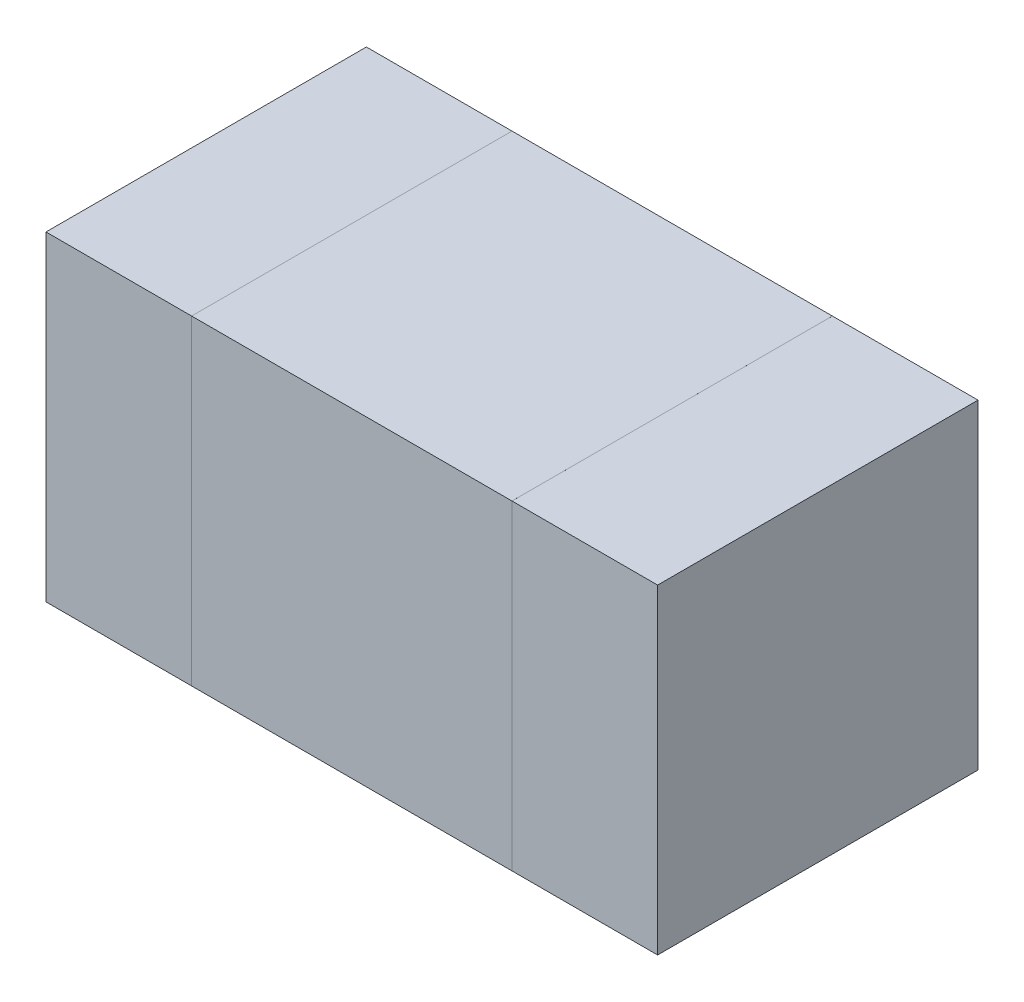
ISO-10303-21;
HEADER;
FILE_DESCRIPTION(('STEP AP214'),'2;1');
FILE_NAME('part.step','',(''),(''),'','','');
FILE_SCHEMA(('AUTOMOTIVE_DESIGN { 1 0 10303 214 1 1 1 1 }'));
ENDSEC;
DATA;
#1=APPLICATION_CONTEXT('core data for automotive mechanical design processes');
#2=APPLICATION_PROTOCOL_DEFINITION('international standard','automotive_design',2000,#1);
#3=PRODUCT_CONTEXT('',#1,'mechanical');
#4=PRODUCT('Part','Part','',(#3));
#5=PRODUCT_RELATED_PRODUCT_CATEGORY('part','',(#4));
#6=PRODUCT_DEFINITION_FORMATION('','',#4);
#7=PRODUCT_DEFINITION_CONTEXT('part definition',#1,'design');
#8=PRODUCT_DEFINITION('design','',#6,#7);
#9=PRODUCT_DEFINITION_SHAPE('','',#8);
#10=(LENGTH_UNIT() NAMED_UNIT(*) SI_UNIT(.MILLI.,.METRE.));
#11=(NAMED_UNIT(*) PLANE_ANGLE_UNIT() SI_UNIT($,.RADIAN.));
#12=(NAMED_UNIT(*) SI_UNIT($,.STERADIAN.) SOLID_ANGLE_UNIT());
#13=UNCERTAINTY_MEASURE_WITH_UNIT(LENGTH_MEASURE(1.E-05),#10,'distance_accuracy_value','');
#14=(GEOMETRIC_REPRESENTATION_CONTEXT(3) GLOBAL_UNCERTAINTY_ASSIGNED_CONTEXT((#13)) GLOBAL_UNIT_ASSIGNED_CONTEXT((#10,
#11,#12)) REPRESENTATION_CONTEXT('',''));
#15=CARTESIAN_POINT('',(0.,0.,0.));
#16=DIRECTION('',(0.,0.,1.));
#17=DIRECTION('',(1.,0.,0.));
#18=AXIS2_PLACEMENT_3D('',#15,#16,#17);
#19=CARTESIAN_POINT('',(0.984994025938,4.585006063711,0.32999934));
#20=DIRECTION('',(0.,0.,-1.));
#21=DIRECTION('',(0.,-1.,0.));
#22=AXIS2_PLACEMENT_3D('',#19,#20,#21);
#23=PLANE('',#22);
#24=DIRECTION('',(1.,0.,0.));
#25=VECTOR('',#24,1.);
#26=CARTESIAN_POINT('',(0.984994025938,4.585006063711,0.32999934));
#27=LINE('',#26,#25);
#28=CARTESIAN_POINT('',(0.984994025938,4.585006063711,0.32999934));
#29=VERTEX_POINT('',#28);
#30=CARTESIAN_POINT('',(1.314995905938,4.585006063711,0.32999934));
#31=VERTEX_POINT('',#30);
#32=EDGE_CURVE('P0_E81',#29,#31,#27,.T.);
#33=ORIENTED_EDGE('',*,*,#32,.T.);
#34=DIRECTION('',(0.,1.,0.));
#35=VECTOR('',#34,1.);
#36=CARTESIAN_POINT('',(1.314995905938,4.585006063711,0.32999934));
#37=LINE('',#36,#35);
#38=CARTESIAN_POINT('',(1.314995905938,4.915005403711,0.32999934));
#39=VERTEX_POINT('',#38);
#40=EDGE_CURVE('P0_E105',#31,#39,#37,.T.);
#41=ORIENTED_EDGE('',*,*,#40,.T.);
#42=DIRECTION('',(-1.,0.,0.));
#43=VECTOR('',#42,1.);
#44=CARTESIAN_POINT('',(1.314995905938,4.915005403711,0.32999934));
#45=LINE('',#44,#43);
#46=CARTESIAN_POINT('',(0.984994025938,4.915005403711,0.32999934));
#47=VERTEX_POINT('',#46);
#48=EDGE_CURVE('P0_E74',#39,#47,#45,.T.);
#49=ORIENTED_EDGE('',*,*,#48,.T.);
#50=DIRECTION('',(0.,-1.,0.));
#51=VECTOR('',#50,1.);
#52=CARTESIAN_POINT('',(0.984994025938,4.915005403711,0.32999934));
#53=LINE('',#52,#51);
#54=EDGE_CURVE('P0_E11',#47,#29,#53,.T.);
#55=ORIENTED_EDGE('',*,*,#54,.T.);
#56=EDGE_LOOP('',(#33,#41,#49,#55));
#57=FACE_BOUND('',#56,.T.);
#58=ADVANCED_FACE('P0_F17',(#57),#23,.F.);
#59=CARTESIAN_POINT('',(0.984994025938,4.585006063711,0.));
#60=DIRECTION('',(0.,0.,-1.));
#61=DIRECTION('',(0.,-1.,0.));
#62=AXIS2_PLACEMENT_3D('',#59,#60,#61);
#63=PLANE('',#62);
#64=DIRECTION('',(0.,-1.,0.));
#65=VECTOR('',#64,1.);
#66=CARTESIAN_POINT('',(0.984994025938,4.915005403711,0.));
#67=LINE('',#66,#65);
#68=CARTESIAN_POINT('',(0.984994025938,4.915005403711,0.));
#69=VERTEX_POINT('',#68);
#70=CARTESIAN_POINT('',(0.984994025938,4.585006063711,0.));
#71=VERTEX_POINT('',#70);
#72=EDGE_CURVE('P0_E25',#69,#71,#67,.T.);
#73=ORIENTED_EDGE('',*,*,#72,.F.);
#74=DIRECTION('',(-1.,0.,0.));
#75=VECTOR('',#74,1.);
#76=CARTESIAN_POINT('',(1.314995905938,4.915005403711,0.));
#77=LINE('',#76,#75);
#78=CARTESIAN_POINT('',(1.314995905938,4.915005403711,0.));
#79=VERTEX_POINT('',#78);
#80=EDGE_CURVE('P0_E109',#79,#69,#77,.T.);
#81=ORIENTED_EDGE('',*,*,#80,.F.);
#82=DIRECTION('',(0.,1.,0.));
#83=VECTOR('',#82,1.);
#84=CARTESIAN_POINT('',(1.314995905938,4.585006063711,0.));
#85=LINE('',#84,#83);
#86=CARTESIAN_POINT('',(1.314995905938,4.585006063711,0.));
#87=VERTEX_POINT('',#86);
#88=EDGE_CURVE('P0_E83',#87,#79,#85,.T.);
#89=ORIENTED_EDGE('',*,*,#88,.F.);
#90=DIRECTION('',(1.,0.,0.));
#91=VECTOR('',#90,1.);
#92=CARTESIAN_POINT('',(0.984994025938,4.585006063711,0.));
#93=LINE('',#92,#91);
#94=EDGE_CURVE('P0_E79',#71,#87,#93,.T.);
#95=ORIENTED_EDGE('',*,*,#94,.F.);
#96=EDGE_LOOP('',(#73,#81,#89,#95));
#97=FACE_BOUND('',#96,.T.);
#98=ADVANCED_FACE('P0_F85',(#97),#63,.T.);
#99=CARTESIAN_POINT('',(0.984994025938,4.915005403711,0.));
#100=DIRECTION('',(1.,0.,0.));
#101=DIRECTION('',(0.,1.,0.));
#102=AXIS2_PLACEMENT_3D('',#99,#100,#101);
#103=PLANE('',#102);
#104=ORIENTED_EDGE('',*,*,#72,.T.);
#105=DIRECTION('',(0.,0.,1.));
#106=VECTOR('',#105,1.);
#107=CARTESIAN_POINT('',(0.984994025938,4.585006063711,0.));
#108=LINE('',#107,#106);
#109=EDGE_CURVE('P0_E68',#71,#29,#108,.T.);
#110=ORIENTED_EDGE('',*,*,#109,.T.);
#111=ORIENTED_EDGE('',*,*,#54,.F.);
#112=DIRECTION('',(0.,0.,1.));
#113=VECTOR('',#112,1.);
#114=CARTESIAN_POINT('',(0.984994025938,4.915005403711,0.));
#115=LINE('',#114,#113);
#116=EDGE_CURVE('P0_E71',#69,#47,#115,.T.);
#117=ORIENTED_EDGE('',*,*,#116,.F.);
#118=EDGE_LOOP('',(#104,#110,#111,#117));
#119=FACE_BOUND('',#118,.T.);
#120=ADVANCED_FACE('P0_F67',(#119),#103,.F.);
#121=CARTESIAN_POINT('',(1.314995905938,4.915005403711,0.));
#122=DIRECTION('',(0.,-1.,0.));
#123=DIRECTION('',(0.,0.,-1.));
#124=AXIS2_PLACEMENT_3D('',#121,#122,#123);
#125=PLANE('',#124);
#126=ORIENTED_EDGE('',*,*,#80,.T.);
#127=ORIENTED_EDGE('',*,*,#116,.T.);
#128=ORIENTED_EDGE('',*,*,#48,.F.);
#129=DIRECTION('',(0.,0.,1.));
#130=VECTOR('',#129,1.);
#131=CARTESIAN_POINT('',(1.314995905938,4.915005403711,0.));
#132=LINE('',#131,#130);
#133=EDGE_CURVE('P0_E101',#79,#39,#132,.T.);
#134=ORIENTED_EDGE('',*,*,#133,.F.);
#135=EDGE_LOOP('',(#126,#127,#128,#134));
#136=FACE_BOUND('',#135,.T.);
#137=ADVANCED_FACE('P0_F115',(#136),#125,.F.);
#138=CARTESIAN_POINT('',(1.314995905938,4.585006063711,0.));
#139=DIRECTION('',(-1.,0.,0.));
#140=DIRECTION('',(0.,0.,1.));
#141=AXIS2_PLACEMENT_3D('',#138,#139,#140);
#142=PLANE('',#141);
#143=ORIENTED_EDGE('',*,*,#88,.T.);
#144=ORIENTED_EDGE('',*,*,#133,.T.);
#145=ORIENTED_EDGE('',*,*,#40,.F.);
#146=DIRECTION('',(0.,0.,1.));
#147=VECTOR('',#146,1.);
#148=CARTESIAN_POINT('',(1.314995905938,4.585006063711,0.));
#149=LINE('',#148,#147);
#150=EDGE_CURVE('P0_E89',#87,#31,#149,.T.);
#151=ORIENTED_EDGE('',*,*,#150,.F.);
#152=EDGE_LOOP('',(#143,#144,#145,#151));
#153=FACE_BOUND('',#152,.T.);
#154=ADVANCED_FACE('P0_F118',(#153),#142,.F.);
#155=CARTESIAN_POINT('',(0.984994025938,4.585006063711,0.));
#156=DIRECTION('',(0.,1.,0.));
#157=DIRECTION('',(1.,0.,0.));
#158=AXIS2_PLACEMENT_3D('',#155,#156,#157);
#159=PLANE('',#158);
#160=ORIENTED_EDGE('',*,*,#94,.T.);
#161=ORIENTED_EDGE('',*,*,#150,.T.);
#162=ORIENTED_EDGE('',*,*,#32,.F.);
#163=ORIENTED_EDGE('',*,*,#109,.F.);
#164=EDGE_LOOP('',(#160,#161,#162,#163));
#165=FACE_BOUND('',#164,.T.);
#166=ADVANCED_FACE('P0_F77',(#165),#159,.F.);
#167=CLOSED_SHELL('',(#58,#98,#120,#137,#154,#166));
#168=MANIFOLD_SOLID_BREP('P0_B1',#167);
#169=CARTESIAN_POINT('',(1.465001579102,4.585003523711,0.32999934));
#170=DIRECTION('',(0.,0.,-1.));
#171=DIRECTION('',(0.,-1.,0.));
#172=AXIS2_PLACEMENT_3D('',#169,#170,#171);
#173=PLANE('',#172);
#174=DIRECTION('',(0.,1.,0.));
#175=VECTOR('',#174,1.);
#176=CARTESIAN_POINT('',(1.465001579102,4.585003523711,0.32999934));
#177=LINE('',#176,#175);
#178=CARTESIAN_POINT('',(1.465001579102,4.585003523711,0.32999934));
#179=VERTEX_POINT('',#178);
#180=CARTESIAN_POINT('',(1.465001579102,4.915005403711,0.32999934));
#181=VERTEX_POINT('',#180);
#182=EDGE_CURVE('P1_E81',#179,#181,#177,.T.);
#183=ORIENTED_EDGE('',*,*,#182,.T.);
#184=DIRECTION('',(-1.,0.,0.));
#185=VECTOR('',#184,1.);
#186=CARTESIAN_POINT('',(1.465001579102,4.915005403711,0.32999934));
#187=LINE('',#186,#185);
#188=CARTESIAN_POINT('',(1.314999339102,4.915005403711,0.32999934));
#189=VERTEX_POINT('',#188);
#190=EDGE_CURVE('P1_E105',#181,#189,#187,.T.);
#191=ORIENTED_EDGE('',*,*,#190,.T.);
#192=DIRECTION('',(0.,-1.,0.));
#193=VECTOR('',#192,1.);
#194=CARTESIAN_POINT('',(1.314999339102,4.915005403711,0.32999934));
#195=LINE('',#194,#193);
#196=CARTESIAN_POINT('',(1.314999339102,4.585003523711,0.32999934));
#197=VERTEX_POINT('',#196);
#198=EDGE_CURVE('P1_E74',#189,#197,#195,.T.);
#199=ORIENTED_EDGE('',*,*,#198,.T.);
#200=DIRECTION('',(1.,0.,0.));
#201=VECTOR('',#200,1.);
#202=CARTESIAN_POINT('',(1.314999339102,4.585003523711,0.32999934));
#203=LINE('',#202,#201);
#204=EDGE_CURVE('P1_E11',#197,#179,#203,.T.);
#205=ORIENTED_EDGE('',*,*,#204,.T.);
#206=EDGE_LOOP('',(#183,#191,#199,#205));
#207=FACE_BOUND('',#206,.T.);
#208=ADVANCED_FACE('P1_F17',(#207),#173,.F.);
#209=CARTESIAN_POINT('',(1.465001579102,4.585003523711,0.));
#210=DIRECTION('',(0.,0.,-1.));
#211=DIRECTION('',(0.,-1.,0.));
#212=AXIS2_PLACEMENT_3D('',#209,#210,#211);
#213=PLANE('',#212);
#214=DIRECTION('',(1.,0.,0.));
#215=VECTOR('',#214,1.);
#216=CARTESIAN_POINT('',(1.314999339102,4.585003523711,0.));
#217=LINE('',#216,#215);
#218=CARTESIAN_POINT('',(1.314999339102,4.585003523711,0.));
#219=VERTEX_POINT('',#218);
#220=CARTESIAN_POINT('',(1.465001579102,4.585003523711,0.));
#221=VERTEX_POINT('',#220);
#222=EDGE_CURVE('P1_E25',#219,#221,#217,.T.);
#223=ORIENTED_EDGE('',*,*,#222,.F.);
#224=DIRECTION('',(0.,-1.,0.));
#225=VECTOR('',#224,1.);
#226=CARTESIAN_POINT('',(1.314999339102,4.915005403711,0.));
#227=LINE('',#226,#225);
#228=CARTESIAN_POINT('',(1.314999339102,4.915005403711,0.));
#229=VERTEX_POINT('',#228);
#230=EDGE_CURVE('P1_E109',#229,#219,#227,.T.);
#231=ORIENTED_EDGE('',*,*,#230,.F.);
#232=DIRECTION('',(-1.,0.,0.));
#233=VECTOR('',#232,1.);
#234=CARTESIAN_POINT('',(1.465001579102,4.915005403711,0.));
#235=LINE('',#234,#233);
#236=CARTESIAN_POINT('',(1.465001579102,4.915005403711,0.));
#237=VERTEX_POINT('',#236);
#238=EDGE_CURVE('P1_E83',#237,#229,#235,.T.);
#239=ORIENTED_EDGE('',*,*,#238,.F.);
#240=DIRECTION('',(0.,1.,0.));
#241=VECTOR('',#240,1.);
#242=CARTESIAN_POINT('',(1.465001579102,4.585003523711,0.));
#243=LINE('',#242,#241);
#244=EDGE_CURVE('P1_E79',#221,#237,#243,.T.);
#245=ORIENTED_EDGE('',*,*,#244,.F.);
#246=EDGE_LOOP('',(#223,#231,#239,#245));
#247=FACE_BOUND('',#246,.T.);
#248=ADVANCED_FACE('P1_F85',(#247),#213,.T.);
#249=CARTESIAN_POINT('',(1.314999339102,4.585003523711,0.));
#250=DIRECTION('',(0.,1.,0.));
#251=DIRECTION('',(1.,0.,0.));
#252=AXIS2_PLACEMENT_3D('',#249,#250,#251);
#253=PLANE('',#252);
#254=ORIENTED_EDGE('',*,*,#222,.T.);
#255=DIRECTION('',(0.,0.,1.));
#256=VECTOR('',#255,1.);
#257=CARTESIAN_POINT('',(1.465001579102,4.585003523711,0.));
#258=LINE('',#257,#256);
#259=EDGE_CURVE('P1_E68',#221,#179,#258,.T.);
#260=ORIENTED_EDGE('',*,*,#259,.T.);
#261=ORIENTED_EDGE('',*,*,#204,.F.);
#262=DIRECTION('',(0.,0.,1.));
#263=VECTOR('',#262,1.);
#264=CARTESIAN_POINT('',(1.314999339102,4.585003523711,0.));
#265=LINE('',#264,#263);
#266=EDGE_CURVE('P1_E71',#219,#197,#265,.T.);
#267=ORIENTED_EDGE('',*,*,#266,.F.);
#268=EDGE_LOOP('',(#254,#260,#261,#267));
#269=FACE_BOUND('',#268,.T.);
#270=ADVANCED_FACE('P1_F67',(#269),#253,.F.);
#271=CARTESIAN_POINT('',(1.314999339102,4.915005403711,0.));
#272=DIRECTION('',(1.,0.,0.));
#273=DIRECTION('',(0.,1.,0.));
#274=AXIS2_PLACEMENT_3D('',#271,#272,#273);
#275=PLANE('',#274);
#276=ORIENTED_EDGE('',*,*,#230,.T.);
#277=ORIENTED_EDGE('',*,*,#266,.T.);
#278=ORIENTED_EDGE('',*,*,#198,.F.);
#279=DIRECTION('',(0.,0.,1.));
#280=VECTOR('',#279,1.);
#281=CARTESIAN_POINT('',(1.314999339102,4.915005403711,0.));
#282=LINE('',#281,#280);
#283=EDGE_CURVE('P1_E101',#229,#189,#282,.T.);
#284=ORIENTED_EDGE('',*,*,#283,.F.);
#285=EDGE_LOOP('',(#276,#277,#278,#284));
#286=FACE_BOUND('',#285,.T.);
#287=ADVANCED_FACE('P1_F115',(#286),#275,.F.);
#288=CARTESIAN_POINT('',(1.465001579102,4.915005403711,0.));
#289=DIRECTION('',(0.,-1.,0.));
#290=DIRECTION('',(0.,0.,-1.));
#291=AXIS2_PLACEMENT_3D('',#288,#289,#290);
#292=PLANE('',#291);
#293=ORIENTED_EDGE('',*,*,#238,.T.);
#294=ORIENTED_EDGE('',*,*,#283,.T.);
#295=ORIENTED_EDGE('',*,*,#190,.F.);
#296=DIRECTION('',(0.,0.,1.));
#297=VECTOR('',#296,1.);
#298=CARTESIAN_POINT('',(1.465001579102,4.915005403711,0.));
#299=LINE('',#298,#297);
#300=EDGE_CURVE('P1_E89',#237,#181,#299,.T.);
#301=ORIENTED_EDGE('',*,*,#300,.F.);
#302=EDGE_LOOP('',(#293,#294,#295,#301));
#303=FACE_BOUND('',#302,.T.);
#304=ADVANCED_FACE('P1_F118',(#303),#292,.F.);
#305=CARTESIAN_POINT('',(1.465001579102,4.585003523711,0.));
#306=DIRECTION('',(-1.,0.,0.));
#307=DIRECTION('',(0.,0.,1.));
#308=AXIS2_PLACEMENT_3D('',#305,#306,#307);
#309=PLANE('',#308);
#310=ORIENTED_EDGE('',*,*,#244,.T.);
#311=ORIENTED_EDGE('',*,*,#300,.T.);
#312=ORIENTED_EDGE('',*,*,#182,.F.);
#313=ORIENTED_EDGE('',*,*,#259,.F.);
#314=EDGE_LOOP('',(#310,#311,#312,#313));
#315=FACE_BOUND('',#314,.T.);
#316=ADVANCED_FACE('P1_F77',(#315),#309,.F.);
#317=CLOSED_SHELL('',(#208,#248,#270,#287,#304,#316));
#318=MANIFOLD_SOLID_BREP('P1_B1',#317);
#319=CARTESIAN_POINT('',(0.985005851563,4.585003523711,0.32999934));
#320=DIRECTION('',(0.,0.,-1.));
#321=DIRECTION('',(0.,-1.,0.));
#322=AXIS2_PLACEMENT_3D('',#319,#320,#321);
#323=PLANE('',#322);
#324=DIRECTION('',(0.,1.,0.));
#325=VECTOR('',#324,1.);
#326=CARTESIAN_POINT('',(0.985005851563,4.585003523711,0.32999934));
#327=LINE('',#326,#325);
#328=CARTESIAN_POINT('',(0.985005851563,4.585003523711,0.32999934));
#329=VERTEX_POINT('',#328);
#330=CARTESIAN_POINT('',(0.985005851563,4.915005403711,0.32999934));
#331=VERTEX_POINT('',#330);
#332=EDGE_CURVE('P2_E81',#329,#331,#327,.T.);
#333=ORIENTED_EDGE('',*,*,#332,.T.);
#334=DIRECTION('',(-1.,0.,0.));
#335=VECTOR('',#334,1.);
#336=CARTESIAN_POINT('',(0.985005851563,4.915005403711,0.32999934));
#337=LINE('',#336,#335);
#338=CARTESIAN_POINT('',(0.835003611563,4.915005403711,0.32999934));
#339=VERTEX_POINT('',#338);
#340=EDGE_CURVE('P2_E79',#331,#339,#337,.T.);
#341=ORIENTED_EDGE('',*,*,#340,.T.);
#342=DIRECTION('',(0.,-1.,0.));
#343=VECTOR('',#342,1.);
#344=CARTESIAN_POINT('',(0.835003611563,4.915005403711,0.32999934));
#345=LINE('',#344,#343);
#346=CARTESIAN_POINT('',(0.835003611563,4.585003523711,0.32999934));
#347=VERTEX_POINT('',#346);
#348=EDGE_CURVE('P2_E68',#339,#347,#345,.T.);
#349=ORIENTED_EDGE('',*,*,#348,.T.);
#350=DIRECTION('',(1.,0.,0.));
#351=VECTOR('',#350,1.);
#352=CARTESIAN_POINT('',(0.835003611563,4.585003523711,0.32999934));
#353=LINE('',#352,#351);
#354=EDGE_CURVE('P2_E11',#347,#329,#353,.T.);
#355=ORIENTED_EDGE('',*,*,#354,.T.);
#356=EDGE_LOOP('',(#333,#341,#349,#355));
#357=FACE_BOUND('',#356,.T.);
#358=ADVANCED_FACE('P2_F17',(#357),#323,.F.);
#359=CARTESIAN_POINT('',(0.985005851563,4.585003523711,0.));
#360=DIRECTION('',(0.,0.,-1.));
#361=DIRECTION('',(0.,-1.,0.));
#362=AXIS2_PLACEMENT_3D('',#359,#360,#361);
#363=PLANE('',#362);
#364=DIRECTION('',(1.,0.,0.));
#365=VECTOR('',#364,1.);
#366=CARTESIAN_POINT('',(0.835003611563,4.585003523711,0.));
#367=LINE('',#366,#365);
#368=CARTESIAN_POINT('',(0.835003611563,4.585003523711,0.));
#369=VERTEX_POINT('',#368);
#370=CARTESIAN_POINT('',(0.985005851563,4.585003523711,0.));
#371=VERTEX_POINT('',#370);
#372=EDGE_CURVE('P2_E26',#369,#371,#367,.T.);
#373=ORIENTED_EDGE('',*,*,#372,.F.);
#374=DIRECTION('',(0.,-1.,0.));
#375=VECTOR('',#374,1.);
#376=CARTESIAN_POINT('',(0.835003611563,4.915005403711,0.));
#377=LINE('',#376,#375);
#378=CARTESIAN_POINT('',(0.835003611563,4.915005403711,0.));
#379=VERTEX_POINT('',#378);
#380=EDGE_CURVE('P2_E61',#379,#369,#377,.T.);
#381=ORIENTED_EDGE('',*,*,#380,.F.);
#382=DIRECTION('',(-1.,0.,0.));
#383=VECTOR('',#382,1.);
#384=CARTESIAN_POINT('',(0.985005851563,4.915005403711,0.));
#385=LINE('',#384,#383);
#386=CARTESIAN_POINT('',(0.985005851563,4.915005403711,0.));
#387=VERTEX_POINT('',#386);
#388=EDGE_CURVE('P2_E88',#387,#379,#385,.T.);
#389=ORIENTED_EDGE('',*,*,#388,.F.);
#390=DIRECTION('',(0.,1.,0.));
#391=VECTOR('',#390,1.);
#392=CARTESIAN_POINT('',(0.985005851563,4.585003523711,0.));
#393=LINE('',#392,#391);
#394=EDGE_CURVE('P2_E151',#371,#387,#393,.T.);
#395=ORIENTED_EDGE('',*,*,#394,.F.);
#396=EDGE_LOOP('',(#373,#381,#389,#395));
#397=FACE_BOUND('',#396,.T.);
#398=ADVANCED_FACE('P2_F132',(#397),#363,.T.);
#399=CARTESIAN_POINT('',(0.835003611563,4.585003523711,0.));
#400=DIRECTION('',(0.,1.,0.));
#401=DIRECTION('',(1.,0.,0.));
#402=AXIS2_PLACEMENT_3D('',#399,#400,#401);
#403=PLANE('',#402);
#404=ORIENTED_EDGE('',*,*,#372,.T.);
#405=DIRECTION('',(0.,0.,1.));
#406=VECTOR('',#405,1.);
#407=CARTESIAN_POINT('',(0.985005851563,4.585003523711,0.));
#408=LINE('',#407,#406);
#409=EDGE_CURVE('P2_E95',#371,#329,#408,.T.);
#410=ORIENTED_EDGE('',*,*,#409,.T.);
#411=ORIENTED_EDGE('',*,*,#354,.F.);
#412=DIRECTION('',(0.,0.,1.));
#413=VECTOR('',#412,1.);
#414=CARTESIAN_POINT('',(0.835003611563,4.585003523711,0.));
#415=LINE('',#414,#413);
#416=EDGE_CURVE('P2_E74',#369,#347,#415,.T.);
#417=ORIENTED_EDGE('',*,*,#416,.F.);
#418=EDGE_LOOP('',(#404,#410,#411,#417));
#419=FACE_BOUND('',#418,.T.);
#420=ADVANCED_FACE('P2_F125',(#419),#403,.F.);
#421=CARTESIAN_POINT('',(0.835003611563,4.915005403711,0.));
#422=DIRECTION('',(1.,0.,0.));
#423=DIRECTION('',(0.,1.,0.));
#424=AXIS2_PLACEMENT_3D('',#421,#422,#423);
#425=PLANE('',#424);
#426=ORIENTED_EDGE('',*,*,#380,.T.);
#427=ORIENTED_EDGE('',*,*,#416,.T.);
#428=ORIENTED_EDGE('',*,*,#348,.F.);
#429=DIRECTION('',(0.,0.,1.));
#430=VECTOR('',#429,1.);
#431=CARTESIAN_POINT('',(0.835003611563,4.915005403711,0.));
#432=LINE('',#431,#430);
#433=EDGE_CURVE('P2_E72',#379,#339,#432,.T.);
#434=ORIENTED_EDGE('',*,*,#433,.F.);
#435=EDGE_LOOP('',(#426,#427,#428,#434));
#436=FACE_BOUND('',#435,.T.);
#437=ADVANCED_FACE('P2_F70',(#436),#425,.F.);
#438=CARTESIAN_POINT('',(0.985005851563,4.915005403711,0.));
#439=DIRECTION('',(0.,-1.,0.));
#440=DIRECTION('',(0.,0.,-1.));
#441=AXIS2_PLACEMENT_3D('',#438,#439,#440);
#442=PLANE('',#441);
#443=ORIENTED_EDGE('',*,*,#388,.T.);
#444=ORIENTED_EDGE('',*,*,#433,.T.);
#445=ORIENTED_EDGE('',*,*,#340,.F.);
#446=DIRECTION('',(0.,0.,1.));
#447=VECTOR('',#446,1.);
#448=CARTESIAN_POINT('',(0.985005851563,4.915005403711,0.));
#449=LINE('',#448,#447);
#450=EDGE_CURVE('P2_E153',#387,#331,#449,.T.);
#451=ORIENTED_EDGE('',*,*,#450,.F.);
#452=EDGE_LOOP('',(#443,#444,#445,#451));
#453=FACE_BOUND('',#452,.T.);
#454=ADVANCED_FACE('P2_F87',(#453),#442,.F.);
#455=CARTESIAN_POINT('',(0.985005851563,4.585003523711,0.));
#456=DIRECTION('',(-1.,0.,0.));
#457=DIRECTION('',(0.,0.,1.));
#458=AXIS2_PLACEMENT_3D('',#455,#456,#457);
#459=PLANE('',#458);
#460=ORIENTED_EDGE('',*,*,#394,.T.);
#461=ORIENTED_EDGE('',*,*,#450,.T.);
#462=ORIENTED_EDGE('',*,*,#332,.F.);
#463=ORIENTED_EDGE('',*,*,#409,.F.);
#464=EDGE_LOOP('',(#460,#461,#462,#463));
#465=FACE_BOUND('',#464,.T.);
#466=ADVANCED_FACE('P2_F106',(#465),#459,.F.);
#467=CLOSED_SHELL('',(#358,#398,#420,#437,#454,#466));
#468=MANIFOLD_SOLID_BREP('P2_B1',#467);
#469=ADVANCED_BREP_SHAPE_REPRESENTATION('',(#18,#168,#318,#468),#14);
#470=SHAPE_DEFINITION_REPRESENTATION(#9,#469);
ENDSEC;
END-ISO-10303-21;
